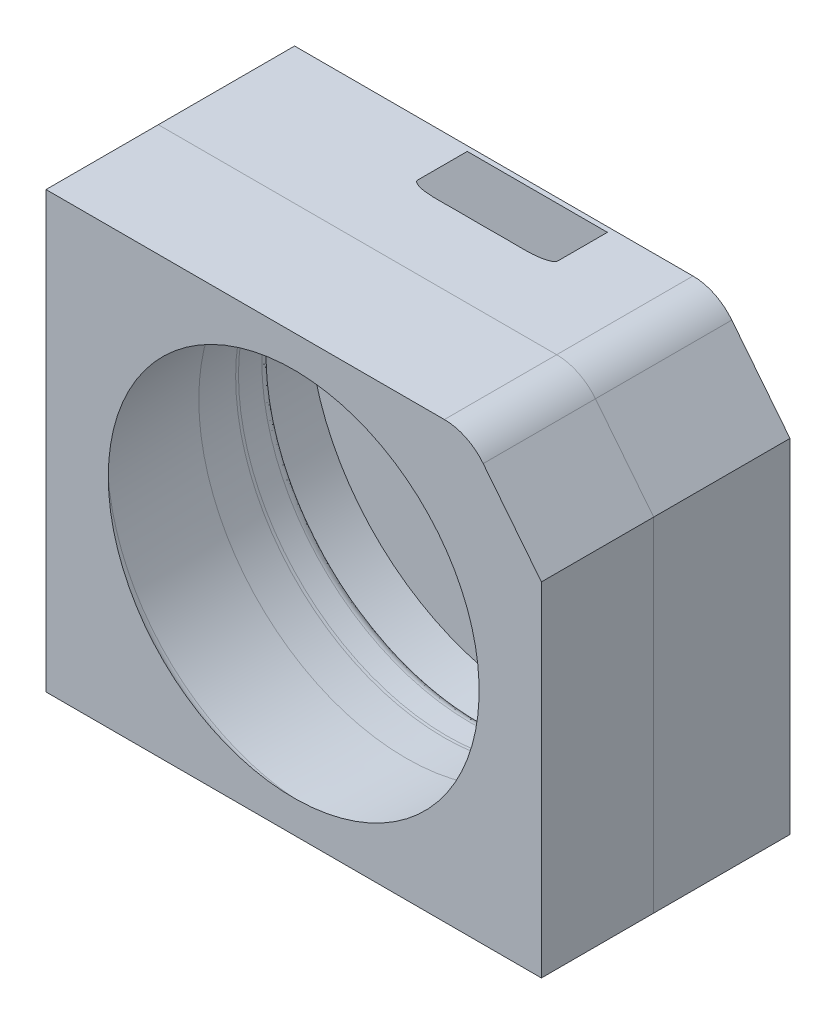
ISO-10303-21;
HEADER;
FILE_DESCRIPTION(('STEP AP214'),'2;1');
FILE_NAME('part.step','',(''),(''),'','','');
FILE_SCHEMA(('AUTOMOTIVE_DESIGN { 1 0 10303 214 1 1 1 1 }'));
ENDSEC;
DATA;
#1=APPLICATION_CONTEXT('core data for automotive mechanical design processes');
#2=APPLICATION_PROTOCOL_DEFINITION('international standard','automotive_design',2000,#1);
#3=PRODUCT_CONTEXT('',#1,'mechanical');
#4=PRODUCT('Part','Part','',(#3));
#5=PRODUCT_RELATED_PRODUCT_CATEGORY('part','',(#4));
#6=PRODUCT_DEFINITION_FORMATION('','',#4);
#7=PRODUCT_DEFINITION_CONTEXT('part definition',#1,'design');
#8=PRODUCT_DEFINITION('design','',#6,#7);
#9=PRODUCT_DEFINITION_SHAPE('','',#8);
#10=(LENGTH_UNIT() NAMED_UNIT(*) SI_UNIT(.MILLI.,.METRE.));
#11=(NAMED_UNIT(*) PLANE_ANGLE_UNIT() SI_UNIT($,.RADIAN.));
#12=(NAMED_UNIT(*) SI_UNIT($,.STERADIAN.) SOLID_ANGLE_UNIT());
#13=UNCERTAINTY_MEASURE_WITH_UNIT(LENGTH_MEASURE(1.E-05),#10,'distance_accuracy_value','');
#14=(GEOMETRIC_REPRESENTATION_CONTEXT(3) GLOBAL_UNCERTAINTY_ASSIGNED_CONTEXT((#13)) GLOBAL_UNIT_ASSIGNED_CONTEXT((#10,
#11,#12)) REPRESENTATION_CONTEXT('',''));
#15=CARTESIAN_POINT('',(0.,0.,0.));
#16=DIRECTION('',(0.,0.,1.));
#17=DIRECTION('',(1.,0.,0.));
#18=AXIS2_PLACEMENT_3D('',#15,#16,#17);
#19=CARTESIAN_POINT('',(0.,0.,82.55));
#20=DIRECTION('',(0.,0.,-1.));
#21=DIRECTION('',(-1.,0.,0.));
#22=AXIS2_PLACEMENT_3D('',#19,#20,#21);
#23=PLANE('',#22);
#24=DIRECTION('',(-1.,0.,0.));
#25=VECTOR('',#24,1.);
#26=CARTESIAN_POINT('',(0.,0.,82.55));
#27=LINE('',#26,#25);
#28=CARTESIAN_POINT('',(300.,0.,82.55));
#29=VERTEX_POINT('',#28);
#30=CARTESIAN_POINT('',(0.,0.,82.55));
#31=VERTEX_POINT('',#30);
#32=EDGE_CURVE('E141',#29,#31,#27,.T.);
#33=ORIENTED_EDGE('',*,*,#32,.T.);
#34=DIRECTION('',(0.,1.,0.));
#35=VECTOR('',#34,1.);
#36=CARTESIAN_POINT('',(0.,263.525,82.55));
#37=LINE('',#36,#35);
#38=CARTESIAN_POINT('',(0.,263.525,82.55));
#39=VERTEX_POINT('',#38);
#40=EDGE_CURVE('E137',#31,#39,#37,.T.);
#41=ORIENTED_EDGE('',*,*,#40,.T.);
#42=DIRECTION('',(-1.,0.,0.));
#43=VECTOR('',#42,1.);
#44=CARTESIAN_POINT('',(0.,263.525,82.55));
#45=LINE('',#44,#43);
#46=CARTESIAN_POINT('',(241.253264434507,263.525,82.55));
#47=VERTEX_POINT('',#46);
#48=EDGE_CURVE('E119',#47,#39,#45,.T.);
#49=ORIENTED_EDGE('',*,*,#48,.F.);
#50=CARTESIAN_POINT('',(241.253264434507,233.525,82.55));
#51=DIRECTION('',(0.,0.,-1.));
#52=DIRECTION('',(-1.,0.,0.));
#53=AXIS2_PLACEMENT_3D('',#50,#51,#52);
#54=CIRCLE('',#53,30.);
#55=CARTESIAN_POINT('',(264.758194807193,252.166841330061,82.55));
#56=VERTEX_POINT('',#55);
#57=EDGE_CURVE('E102',#47,#56,#54,.T.);
#58=ORIENTED_EDGE('',*,*,#57,.T.);
#59=DIRECTION('',(0.621394711002044,-0.783497679089534,0.));
#60=VECTOR('',#59,1.);
#61=CARTESIAN_POINT('',(264.758194807193,252.166841330061,82.55));
#62=LINE('',#61,#60);
#63=CARTESIAN_POINT('',(300.,207.73152173913,82.55));
#64=VERTEX_POINT('',#63);
#65=EDGE_CURVE('E116',#56,#64,#62,.T.);
#66=ORIENTED_EDGE('',*,*,#65,.T.);
#67=DIRECTION('',(0.,-1.,0.));
#68=VECTOR('',#67,1.);
#69=CARTESIAN_POINT('',(300.,0.,82.55));
#70=LINE('',#69,#68);
#71=EDGE_CURVE('E120',#64,#29,#70,.T.);
#72=ORIENTED_EDGE('',*,*,#71,.T.);
#73=EDGE_LOOP('',(#33,#41,#49,#58,#66,#72));
#74=FACE_BOUND('',#73,.T.);
#75=CARTESIAN_POINT('',(149.999999999996,131.762500000001,82.55));
#76=DIRECTION('',(0.,0.,-1.));
#77=DIRECTION('',(-1.,0.,0.));
#78=AXIS2_PLACEMENT_3D('',#75,#76,#77);
#79=CIRCLE('',#78,125.464805775742);
#80=CARTESIAN_POINT('',(24.5351942242544,131.762500000001,82.55));
#81=VERTEX_POINT('',#80);
#82=EDGE_CURVE('E125',#81,#81,#79,.F.);
#83=ORIENTED_EDGE('',*,*,#82,.T.);
#84=EDGE_LOOP('',(#83));
#85=FACE_BOUND('',#84,.T.);
#86=ADVANCED_FACE('F44',(#74,#85),#23,.T.);
#87=CARTESIAN_POINT('',(0.,263.525,0.));
#88=DIRECTION('',(0.,1.,0.));
#89=DIRECTION('',(0.,0.,1.));
#90=AXIS2_PLACEMENT_3D('',#87,#88,#89);
#91=PLANE('',#90);
#92=DIRECTION('',(0.,0.,-1.));
#93=VECTOR('',#92,1.);
#94=CARTESIAN_POINT('',(241.253264434507,263.525,286.76549888));
#95=LINE('',#94,#93);
#96=CARTESIAN_POINT('',(241.253264434507,263.525,150.542283063692));
#97=VERTEX_POINT('',#96);
#98=EDGE_CURVE('E12',#97,#47,#95,.T.);
#99=ORIENTED_EDGE('',*,*,#98,.T.);
#100=ORIENTED_EDGE('',*,*,#48,.T.);
#101=DIRECTION('',(0.,0.,-1.));
#102=VECTOR('',#101,1.);
#103=CARTESIAN_POINT('',(0.,263.525,286.76549888));
#104=LINE('',#103,#102);
#105=CARTESIAN_POINT('',(0.,263.525,150.542283063692));
#106=VERTEX_POINT('',#105);
#107=EDGE_CURVE('E52',#106,#39,#104,.T.);
#108=ORIENTED_EDGE('',*,*,#107,.F.);
#109=DIRECTION('',(-1.,0.,0.));
#110=VECTOR('',#109,1.);
#111=CARTESIAN_POINT('',(0.,263.525,150.542283063692));
#112=LINE('',#111,#110);
#113=EDGE_CURVE('E140',#97,#106,#112,.T.);
#114=ORIENTED_EDGE('',*,*,#113,.F.);
#115=EDGE_LOOP('',(#99,#100,#108,#114));
#116=FACE_BOUND('',#115,.T.);
#117=ADVANCED_FACE('F139',(#116),#91,.T.);
#118=CARTESIAN_POINT('',(0.,0.,286.76549888));
#119=DIRECTION('',(0.,1.,0.));
#120=DIRECTION('',(0.,0.,1.));
#121=AXIS2_PLACEMENT_3D('',#118,#119,#120);
#122=PLANE('',#121);
#123=ORIENTED_EDGE('',*,*,#32,.F.);
#124=DIRECTION('',(0.,0.,-1.));
#125=VECTOR('',#124,1.);
#126=CARTESIAN_POINT('',(300.,0.,286.76549888));
#127=LINE('',#126,#125);
#128=CARTESIAN_POINT('',(300.,0.,150.542283063692));
#129=VERTEX_POINT('',#128);
#130=EDGE_CURVE('E132',#129,#29,#127,.T.);
#131=ORIENTED_EDGE('',*,*,#130,.F.);
#132=DIRECTION('',(-1.,0.,0.));
#133=VECTOR('',#132,1.);
#134=CARTESIAN_POINT('',(0.,0.,150.542283063692));
#135=LINE('',#134,#133);
#136=CARTESIAN_POINT('',(0.,0.,150.542283063692));
#137=VERTEX_POINT('',#136);
#138=EDGE_CURVE('E59',#129,#137,#135,.T.);
#139=ORIENTED_EDGE('',*,*,#138,.T.);
#140=DIRECTION('',(0.,0.,-1.));
#141=VECTOR('',#140,1.);
#142=CARTESIAN_POINT('',(0.,0.,286.76549888));
#143=LINE('',#142,#141);
#144=EDGE_CURVE('E134',#137,#31,#143,.T.);
#145=ORIENTED_EDGE('',*,*,#144,.T.);
#146=EDGE_LOOP('',(#123,#131,#139,#145));
#147=FACE_BOUND('',#146,.T.);
#148=ADVANCED_FACE('F184',(#147),#122,.F.);
#149=CARTESIAN_POINT('',(0.,263.525,286.76549888));
#150=DIRECTION('',(1.,0.,0.));
#151=DIRECTION('',(0.,0.,-1.));
#152=AXIS2_PLACEMENT_3D('',#149,#150,#151);
#153=PLANE('',#152);
#154=ORIENTED_EDGE('',*,*,#40,.F.);
#155=ORIENTED_EDGE('',*,*,#144,.F.);
#156=DIRECTION('',(0.,1.,0.));
#157=VECTOR('',#156,1.);
#158=CARTESIAN_POINT('',(0.,263.525,150.542283063692));
#159=LINE('',#158,#157);
#160=EDGE_CURVE('E66',#137,#106,#159,.T.);
#161=ORIENTED_EDGE('',*,*,#160,.T.);
#162=ORIENTED_EDGE('',*,*,#107,.T.);
#163=EDGE_LOOP('',(#154,#155,#161,#162));
#164=FACE_BOUND('',#163,.T.);
#165=ADVANCED_FACE('F46',(#164),#153,.F.);
#166=CARTESIAN_POINT('',(300.,0.,286.76549888));
#167=DIRECTION('',(-1.,0.,0.));
#168=DIRECTION('',(0.,-1.,0.));
#169=AXIS2_PLACEMENT_3D('',#166,#167,#168);
#170=PLANE('',#169);
#171=ORIENTED_EDGE('',*,*,#71,.F.);
#172=DIRECTION('',(0.,0.,-1.));
#173=VECTOR('',#172,1.);
#174=CARTESIAN_POINT('',(300.,207.73152173913,286.76549888));
#175=LINE('',#174,#173);
#176=CARTESIAN_POINT('',(300.,207.73152173913,150.542283063692));
#177=VERTEX_POINT('',#176);
#178=EDGE_CURVE('E107',#177,#64,#175,.T.);
#179=ORIENTED_EDGE('',*,*,#178,.F.);
#180=DIRECTION('',(0.,-1.,0.));
#181=VECTOR('',#180,1.);
#182=CARTESIAN_POINT('',(300.,0.,150.542283063692));
#183=LINE('',#182,#181);
#184=EDGE_CURVE('E155',#177,#129,#183,.T.);
#185=ORIENTED_EDGE('',*,*,#184,.T.);
#186=ORIENTED_EDGE('',*,*,#130,.T.);
#187=EDGE_LOOP('',(#171,#179,#185,#186));
#188=FACE_BOUND('',#187,.T.);
#189=ADVANCED_FACE('F193',(#188),#170,.F.);
#190=CARTESIAN_POINT('',(241.253264434507,233.525,286.76549888));
#191=DIRECTION('',(0.,0.,-1.));
#192=DIRECTION('',(-1.,0.,0.));
#193=AXIS2_PLACEMENT_3D('',#190,#191,#192);
#194=CYLINDRICAL_SURFACE('',#193,30.);
#195=ORIENTED_EDGE('',*,*,#57,.F.);
#196=ORIENTED_EDGE('',*,*,#98,.F.);
#197=CARTESIAN_POINT('',(241.253264434507,233.525,150.542283063692));
#198=DIRECTION('',(0.,0.,-1.));
#199=DIRECTION('',(-1.,0.,0.));
#200=AXIS2_PLACEMENT_3D('',#197,#198,#199);
#201=CIRCLE('',#200,30.);
#202=CARTESIAN_POINT('',(264.758194807193,252.166841330061,150.542283063692));
#203=VERTEX_POINT('',#202);
#204=EDGE_CURVE('E104',#97,#203,#201,.T.);
#205=ORIENTED_EDGE('',*,*,#204,.T.);
#206=DIRECTION('',(0.,0.,-1.));
#207=VECTOR('',#206,1.);
#208=CARTESIAN_POINT('',(264.758194807193,252.166841330061,286.76549888));
#209=LINE('',#208,#207);
#210=EDGE_CURVE('E98',#203,#56,#209,.T.);
#211=ORIENTED_EDGE('',*,*,#210,.T.);
#212=EDGE_LOOP('',(#195,#196,#205,#211));
#213=FACE_BOUND('',#212,.T.);
#214=ADVANCED_FACE('F100',(#213),#194,.T.);
#215=CARTESIAN_POINT('',(264.758194807193,252.166841330061,286.76549888));
#216=DIRECTION('',(-0.783497679089534,-0.621394711002044,0.));
#217=DIRECTION('',(0.621394711002044,-0.783497679089534,0.));
#218=AXIS2_PLACEMENT_3D('',#215,#216,#217);
#219=PLANE('',#218);
#220=ORIENTED_EDGE('',*,*,#65,.F.);
#221=ORIENTED_EDGE('',*,*,#210,.F.);
#222=DIRECTION('',(0.621394711002044,-0.783497679089534,0.));
#223=VECTOR('',#222,1.);
#224=CARTESIAN_POINT('',(264.758194807193,252.166841330061,150.542283063692));
#225=LINE('',#224,#223);
#226=EDGE_CURVE('E153',#203,#177,#225,.T.);
#227=ORIENTED_EDGE('',*,*,#226,.T.);
#228=ORIENTED_EDGE('',*,*,#178,.T.);
#229=EDGE_LOOP('',(#220,#221,#227,#228));
#230=FACE_BOUND('',#229,.T.);
#231=ADVANCED_FACE('F122',(#230),#219,.F.);
#232=CARTESIAN_POINT('',(149.999999999997,131.762500000001,139.906228771618));
#233=DIRECTION('',(0.,0.,-1.));
#234=DIRECTION('',(-1.,0.,0.));
#235=AXIS2_PLACEMENT_3D('',#232,#233,#234);
#236=CONICAL_SURFACE('',#235,123.461882131892,0.0349065850398867);
#237=CARTESIAN_POINT('',(149.999999999997,131.762500000001,139.906228771618));
#238=DIRECTION('',(0.,0.,1.));
#239=DIRECTION('',(1.,0.,0.));
#240=AXIS2_PLACEMENT_3D('',#237,#238,#239);
#241=CIRCLE('',#240,123.461882131892);
#242=CARTESIAN_POINT('',(273.46188213189,131.762500000001,139.906228771616));
#243=VERTEX_POINT('',#242);
#244=EDGE_CURVE('E149',#243,#243,#241,.T.);
#245=ORIENTED_EDGE('',*,*,#244,.T.);
#246=EDGE_LOOP('',(#245));
#247=FACE_BOUND('',#246,.T.);
#248=ORIENTED_EDGE('',*,*,#82,.F.);
#249=EDGE_LOOP('',(#248));
#250=FACE_BOUND('',#249,.T.);
#251=ADVANCED_FACE('F170',(#247,#250),#236,.F.);
#252=CARTESIAN_POINT('',(0.,0.,150.542283063692));
#253=DIRECTION('',(0.,0.,-1.));
#254=DIRECTION('',(-1.,0.,0.));
#255=AXIS2_PLACEMENT_3D('',#252,#253,#254);
#256=PLANE('',#255);
#257=ORIENTED_EDGE('',*,*,#204,.F.);
#258=ORIENTED_EDGE('',*,*,#113,.T.);
#259=ORIENTED_EDGE('',*,*,#160,.F.);
#260=ORIENTED_EDGE('',*,*,#138,.F.);
#261=ORIENTED_EDGE('',*,*,#184,.F.);
#262=ORIENTED_EDGE('',*,*,#226,.F.);
#263=EDGE_LOOP('',(#257,#258,#259,#260,#261,#262));
#264=FACE_BOUND('',#263,.T.);
#265=CARTESIAN_POINT('',(149.999999999993,131.7625,150.542283063692));
#266=DIRECTION('',(0.,0.,-1.));
#267=DIRECTION('',(-1.,0.,0.));
#268=AXIS2_PLACEMENT_3D('',#265,#266,#267);
#269=CIRCLE('',#268,112.298492350913);
#270=CARTESIAN_POINT('',(37.7015076490804,131.7625,150.542283063692));
#271=VERTEX_POINT('',#270);
#272=EDGE_CURVE('E156',#271,#271,#269,.F.);
#273=ORIENTED_EDGE('',*,*,#272,.F.);
#274=EDGE_LOOP('',(#273));
#275=FACE_BOUND('',#274,.T.);
#276=ADVANCED_FACE('F167',(#264,#275),#256,.F.);
#277=CARTESIAN_POINT('',(149.999999999997,131.762500000001,139.592133301296));
#278=DIRECTION('',(0.,0.,1.));
#279=DIRECTION('',(1.,0.,0.));
#280=AXIS2_PLACEMENT_3D('',#277,#278,#279);
#281=TOROIDAL_SURFACE('',#280,114.46736468872,9.);
#282=ORIENTED_EDGE('',*,*,#244,.F.);
#283=EDGE_LOOP('',(#282));
#284=FACE_BOUND('',#283,.T.);
#285=CARTESIAN_POINT('',(149.999999999998,131.762500000001,147.74451663055));
#286=DIRECTION('',(0.,0.,1.));
#287=DIRECTION('',(1.,0.,0.));
#288=AXIS2_PLACEMENT_3D('',#285,#286,#287);
#289=CIRCLE('',#288,118.280322340321);
#290=CARTESIAN_POINT('',(268.280322340319,131.762500000001,147.744516630548));
#291=VERTEX_POINT('',#290);
#292=EDGE_CURVE('E108',#291,#291,#289,.T.);
#293=ORIENTED_EDGE('',*,*,#292,.T.);
#294=EDGE_LOOP('',(#293));
#295=FACE_BOUND('',#294,.T.);
#296=ADVANCED_FACE('F169',(#284,#295),#281,.F.);
#297=CARTESIAN_POINT('',(149.999999999998,131.7625,156.662637537934));
#298=DIRECTION('',(0.,0.,-1.));
#299=DIRECTION('',(-1.,0.,0.));
#300=AXIS2_PLACEMENT_3D('',#297,#298,#299);
#301=CONICAL_SURFACE('',#300,99.2127252525065,1.13331210913781);
#302=ORIENTED_EDGE('',*,*,#272,.T.);
#303=EDGE_LOOP('',(#302));
#304=FACE_BOUND('',#303,.T.);
#305=ORIENTED_EDGE('',*,*,#292,.F.);
#306=EDGE_LOOP('',(#305));
#307=FACE_BOUND('',#306,.T.);
#308=ADVANCED_FACE('F164',(#304,#307),#301,.F.);
#309=CLOSED_SHELL('',(#86,#117,#148,#165,#189,#214,#231,#251,#276,#296,#308));
#310=MANIFOLD_SOLID_BREP('B2',#309);
#311=CARTESIAN_POINT('',(0.,0.,82.55));
#312=DIRECTION('',(0.,0.,-1.));
#313=DIRECTION('',(-1.,0.,0.));
#314=AXIS2_PLACEMENT_3D('',#311,#312,#313);
#315=PLANE('',#314);
#316=CARTESIAN_POINT('',(149.999999999996,131.762500000001,82.55));
#317=DIRECTION('',(0.,0.,-1.));
#318=DIRECTION('',(-1.,0.,0.));
#319=AXIS2_PLACEMENT_3D('',#316,#317,#318);
#320=CIRCLE('',#319,125.464805775742);
#321=CARTESIAN_POINT('',(24.5351942242544,131.762500000001,82.55));
#322=VERTEX_POINT('',#321);
#323=EDGE_CURVE('E526',#322,#322,#320,.F.);
#324=ORIENTED_EDGE('',*,*,#323,.F.);
#325=EDGE_LOOP('',(#324));
#326=FACE_BOUND('',#325,.T.);
#327=DIRECTION('',(-1.,0.,0.));
#328=VECTOR('',#327,1.);
#329=CARTESIAN_POINT('',(0.,0.,82.55));
#330=LINE('',#329,#328);
#331=CARTESIAN_POINT('',(300.,0.,82.55));
#332=VERTEX_POINT('',#331);
#333=CARTESIAN_POINT('',(0.,0.,82.55));
#334=VERTEX_POINT('',#333);
#335=EDGE_CURVE('E290',#332,#334,#330,.T.);
#336=ORIENTED_EDGE('',*,*,#335,.F.);
#337=DIRECTION('',(0.,-1.,0.));
#338=VECTOR('',#337,1.);
#339=CARTESIAN_POINT('',(300.,0.,82.55));
#340=LINE('',#339,#338);
#341=CARTESIAN_POINT('',(300.,207.73152173913,82.55));
#342=VERTEX_POINT('',#341);
#343=EDGE_CURVE('E536',#342,#332,#340,.T.);
#344=ORIENTED_EDGE('',*,*,#343,.F.);
#345=DIRECTION('',(0.621394711002044,-0.783497679089534,0.));
#346=VECTOR('',#345,1.);
#347=CARTESIAN_POINT('',(264.758194807193,252.166841330061,82.55));
#348=LINE('',#347,#346);
#349=CARTESIAN_POINT('',(264.758194807193,252.166841330061,82.55));
#350=VERTEX_POINT('',#349);
#351=EDGE_CURVE('E529',#350,#342,#348,.T.);
#352=ORIENTED_EDGE('',*,*,#351,.F.);
#353=CARTESIAN_POINT('',(241.253264434507,233.525,82.55));
#354=DIRECTION('',(0.,0.,-1.));
#355=DIRECTION('',(-1.,0.,0.));
#356=AXIS2_PLACEMENT_3D('',#353,#354,#355);
#357=CIRCLE('',#356,30.);
#358=CARTESIAN_POINT('',(241.253264434507,263.525,82.55));
#359=VERTEX_POINT('',#358);
#360=EDGE_CURVE('E532',#359,#350,#357,.T.);
#361=ORIENTED_EDGE('',*,*,#360,.F.);
#362=DIRECTION('',(-1.,0.,0.));
#363=VECTOR('',#362,1.);
#364=CARTESIAN_POINT('',(0.,263.525,82.55));
#365=LINE('',#364,#363);
#366=CARTESIAN_POINT('',(0.,263.525,82.55));
#367=VERTEX_POINT('',#366);
#368=EDGE_CURVE('E42',#359,#367,#365,.T.);
#369=ORIENTED_EDGE('',*,*,#368,.T.);
#370=DIRECTION('',(0.,1.,0.));
#371=VECTOR('',#370,1.);
#372=CARTESIAN_POINT('',(0.,263.525,82.55));
#373=LINE('',#372,#371);
#374=EDGE_CURVE('E285',#334,#367,#373,.T.);
#375=ORIENTED_EDGE('',*,*,#374,.F.);
#376=EDGE_LOOP('',(#336,#344,#352,#361,#369,#375));
#377=FACE_BOUND('',#376,.T.);
#378=ADVANCED_FACE('F282',(#326,#377),#315,.F.);
#379=CARTESIAN_POINT('',(149.999999999999,131.7625,200.400182821007));
#380=DIRECTION('',(0.,0.,1.));
#381=DIRECTION('',(1.,0.,0.));
#382=AXIS2_PLACEMENT_3D('',#379,#380,#381);
#383=CYLINDRICAL_SURFACE('',#382,126.302452500002);
#384=CARTESIAN_POINT('',(149.999999999996,131.762500000001,43.5629362424853));
#385=DIRECTION('',(0.,0.,1.));
#386=DIRECTION('',(1.,0.,0.));
#387=AXIS2_PLACEMENT_3D('',#384,#385,#386);
#388=CIRCLE('',#387,126.302452500002);
#389=CARTESIAN_POINT('',(276.302452499998,131.762500000001,43.5629362424831));
#390=VERTEX_POINT('',#389);
#391=EDGE_CURVE('E524',#390,#390,#388,.T.);
#392=ORIENTED_EDGE('',*,*,#391,.F.);
#393=EDGE_LOOP('',(#392));
#394=FACE_BOUND('',#393,.T.);
#395=CARTESIAN_POINT('',(149.999999999996,131.762500000001,57.6901829960745));
#396=DIRECTION('',(0.,0.,1.));
#397=DIRECTION('',(1.,0.,0.));
#398=AXIS2_PLACEMENT_3D('',#395,#396,#397);
#399=CIRCLE('',#398,126.302452500002);
#400=CARTESIAN_POINT('',(276.302452499998,131.762500000001,57.6901829960723));
#401=VERTEX_POINT('',#400);
#402=EDGE_CURVE('E522',#401,#401,#399,.T.);
#403=ORIENTED_EDGE('',*,*,#402,.T.);
#404=EDGE_LOOP('',(#403));
#405=FACE_BOUND('',#404,.T.);
#406=ADVANCED_FACE('F427',(#394,#405),#383,.F.);
#407=CARTESIAN_POINT('',(149.999999999996,131.762500000001,57.6901829960742));
#408=DIRECTION('',(0.,0.,1.));
#409=DIRECTION('',(1.,0.,0.));
#410=AXIS2_PLACEMENT_3D('',#407,#408,#409);
#411=TOROIDAL_SURFACE('',#410,76.302452500002,50.);
#412=CARTESIAN_POINT('',(149.999999999996,131.762500000001,59.4351578311995));
#413=DIRECTION('',(0.,0.,1.));
#414=DIRECTION('',(1.,0.,0.));
#415=AXIS2_PLACEMENT_3D('',#412,#413,#414);
#416=CIRCLE('',#415,126.271993850957);
#417=CARTESIAN_POINT('',(276.271993850953,131.762500000001,59.4351578311973));
#418=VERTEX_POINT('',#417);
#419=EDGE_CURVE('E407',#418,#418,#416,.T.);
#420=ORIENTED_EDGE('',*,*,#419,.T.);
#421=EDGE_LOOP('',(#420));
#422=FACE_BOUND('',#421,.T.);
#423=ORIENTED_EDGE('',*,*,#402,.F.);
#424=EDGE_LOOP('',(#423));
#425=FACE_BOUND('',#424,.T.);
#426=ADVANCED_FACE('F589',(#422,#425),#411,.F.);
#427=CARTESIAN_POINT('',(149.999999999997,131.762500000001,139.906228771618));
#428=DIRECTION('',(0.,0.,-1.));
#429=DIRECTION('',(-1.,0.,0.));
#430=AXIS2_PLACEMENT_3D('',#427,#428,#429);
#431=CONICAL_SURFACE('',#430,123.461882131892,0.0349065850398867);
#432=ORIENTED_EDGE('',*,*,#323,.T.);
#433=EDGE_LOOP('',(#432));
#434=FACE_BOUND('',#433,.T.);
#435=ORIENTED_EDGE('',*,*,#419,.F.);
#436=EDGE_LOOP('',(#435));
#437=FACE_BOUND('',#436,.T.);
#438=ADVANCED_FACE('F605',(#434,#437),#431,.F.);
#439=CARTESIAN_POINT('',(0.,-28.,0.));
#440=DIRECTION('',(0.,-1.,0.));
#441=DIRECTION('',(0.,0.,-1.));
#442=AXIS2_PLACEMENT_3D('',#439,#440,#441);
#443=PLANE('',#442);
#444=DIRECTION('',(0.,0.,-1.));
#445=VECTOR('',#444,1.);
#446=CARTESIAN_POINT('',(60.,-28.,55.));
#447=LINE('',#446,#445);
#448=CARTESIAN_POINT('',(60.,-28.,55.));
#449=VERTEX_POINT('',#448);
#450=CARTESIAN_POINT('',(60.,-28.,0.));
#451=VERTEX_POINT('',#450);
#452=EDGE_CURVE('E508',#449,#451,#447,.T.);
#453=ORIENTED_EDGE('',*,*,#452,.T.);
#454=DIRECTION('',(1.,0.,0.));
#455=VECTOR('',#454,1.);
#456=CARTESIAN_POINT('',(60.,-28.,0.));
#457=LINE('',#456,#455);
#458=CARTESIAN_POINT('',(240.,-28.,0.));
#459=VERTEX_POINT('',#458);
#460=EDGE_CURVE('E516',#451,#459,#457,.T.);
#461=ORIENTED_EDGE('',*,*,#460,.T.);
#462=DIRECTION('',(0.,0.,1.));
#463=VECTOR('',#462,1.);
#464=CARTESIAN_POINT('',(240.,-28.,0.));
#465=LINE('',#464,#463);
#466=CARTESIAN_POINT('',(240.,-28.,55.));
#467=VERTEX_POINT('',#466);
#468=EDGE_CURVE('E514',#459,#467,#465,.T.);
#469=ORIENTED_EDGE('',*,*,#468,.T.);
#470=DIRECTION('',(-1.,0.,0.));
#471=VECTOR('',#470,1.);
#472=CARTESIAN_POINT('',(240.,-28.,55.));
#473=LINE('',#472,#471);
#474=EDGE_CURVE('E503',#467,#449,#473,.T.);
#475=ORIENTED_EDGE('',*,*,#474,.T.);
#476=EDGE_LOOP('',(#453,#461,#469,#475));
#477=FACE_BOUND('',#476,.T.);
#478=ADVANCED_FACE('F558',(#477),#443,.T.);
#479=CARTESIAN_POINT('',(149.999999999995,131.762500000001,3.00000000251865));
#480=DIRECTION('',(0.,0.,1.));
#481=DIRECTION('',(1.,0.,0.));
#482=AXIS2_PLACEMENT_3D('',#479,#480,#481);
#483=PLANE('',#482);
#484=CARTESIAN_POINT('',(149.999999999995,131.762500000001,3.00000000251865));
#485=DIRECTION('',(0.,0.,1.));
#486=DIRECTION('',(1.,0.,0.));
#487=AXIS2_PLACEMENT_3D('',#484,#485,#486);
#488=CIRCLE('',#487,138.427487940002);
#489=CARTESIAN_POINT('',(107.564012782426,263.525,3.00000000251986));
#490=VERTEX_POINT('',#489);
#491=CARTESIAN_POINT('',(192.435987217564,263.525,3.00000000251837));
#492=VERTEX_POINT('',#491);
#493=EDGE_CURVE('E386',#490,#492,#488,.T.);
#494=ORIENTED_EDGE('',*,*,#493,.T.);
#495=DIRECTION('',(-1.,0.,0.));
#496=VECTOR('',#495,1.);
#497=CARTESIAN_POINT('',(149.999999999995,263.525,3.00000000251911));
#498=LINE('',#497,#496);
#499=EDGE_CURVE('E399',#492,#490,#498,.T.);
#500=ORIENTED_EDGE('',*,*,#499,.T.);
#501=EDGE_LOOP('',(#494,#500));
#502=FACE_BOUND('',#501,.T.);
#503=ADVANCED_FACE('F457',(#502),#483,.T.);
#504=CARTESIAN_POINT('',(149.999999999999,131.7625,200.400182821007));
#505=DIRECTION('',(0.,0.,1.));
#506=DIRECTION('',(1.,0.,0.));
#507=AXIS2_PLACEMENT_3D('',#504,#505,#506);
#508=CYLINDRICAL_SURFACE('',#507,138.427487940002);
#509=DIRECTION('',(0.,0.,1.));
#510=VECTOR('',#509,1.);
#511=CARTESIAN_POINT('',(107.564012782432,263.525,200.400182821008));
#512=LINE('',#511,#510);
#513=CARTESIAN_POINT('',(107.564012782429,263.525000000001,33.0000000025199));
#514=VERTEX_POINT('',#513);
#515=EDGE_CURVE('E382',#514,#490,#512,.F.);
#516=ORIENTED_EDGE('',*,*,#515,.F.);
#517=CARTESIAN_POINT('',(149.999999999996,131.762500000001,33.0000000025187));
#518=DIRECTION('',(0.,0.,1.));
#519=DIRECTION('',(1.,0.,0.));
#520=AXIS2_PLACEMENT_3D('',#517,#518,#519);
#521=CIRCLE('',#520,138.427487940002);
#522=CARTESIAN_POINT('',(192.435987217562,263.525000000001,33.0000000025184));
#523=VERTEX_POINT('',#522);
#524=EDGE_CURVE('E374',#514,#523,#521,.T.);
#525=ORIENTED_EDGE('',*,*,#524,.T.);
#526=DIRECTION('',(0.,0.,1.));
#527=VECTOR('',#526,1.);
#528=CARTESIAN_POINT('',(192.435987217565,263.525,200.400182821006));
#529=LINE('',#528,#527);
#530=EDGE_CURVE('E379',#492,#523,#529,.T.);
#531=ORIENTED_EDGE('',*,*,#530,.F.);
#532=ORIENTED_EDGE('',*,*,#493,.F.);
#533=EDGE_LOOP('',(#516,#525,#531,#532));
#534=FACE_BOUND('',#533,.T.);
#535=ADVANCED_FACE('F376',(#534),#508,.F.);
#536=CARTESIAN_POINT('',(283.519735499998,131.762500000001,37.2754741948837));
#537=CARTESIAN_POINT('',(286.705561076155,131.762500000001,37.7272814708559));
#538=CARTESIAN_POINT('',(288.427487939998,131.762500000001,35.3951219955774));
#539=CARTESIAN_POINT('',(288.427487939998,131.762500000001,33.0000000025163));
#540=(BOUNDED_CURVE() B_SPLINE_CURVE(3,(#536,#537,#538,#539),.UNSPECIFIED.,.F.,
.F.) B_SPLINE_CURVE_WITH_KNOTS((4,4),(0.,1.),
.UNSPECIFIED.) CURVE() GEOMETRIC_REPRESENTATION_ITEM() RATIONAL_B_SPLINE_CURVE((0.255591691964592,
0.242825015050017,0.327183181081988,0.508666190060503)) REPRESENTATION_ITEM(''));
#541=CARTESIAN_POINT('',(149.999999999999,131.7625,200.400182821007));
#542=DIRECTION('',(0.,0.,1.));
#543=AXIS1_PLACEMENT('',#541,#542);
#544=SURFACE_OF_REVOLUTION('',#540,#543);
#545=CARTESIAN_POINT('',(192.435987217564,263.525,33.0000000025184));
#546=CARTESIAN_POINT('',(192.436011088802,263.525,33.0434393153706));
#547=CARTESIAN_POINT('',(192.433856176102,263.525,33.08686429808));
#548=CARTESIAN_POINT('',(192.425375267438,263.525,33.1732424197555));
#549=CARTESIAN_POINT('',(192.419055448113,263.525,33.2161961618266));
#550=CARTESIAN_POINT('',(192.402545183961,263.525,33.3007307171293));
#551=CARTESIAN_POINT('',(192.392409485246,263.525,33.3423223025522));
#552=CARTESIAN_POINT('',(192.368567292052,263.525,33.4244716410908));
#553=CARTESIAN_POINT('',(192.354859356591,263.525,33.4650289697393));
#554=CARTESIAN_POINT('',(192.301511476489,263.525,33.6040140451591));
#555=CARTESIAN_POINT('',(192.253507947504,263.525,33.6992960167715));
#556=CARTESIAN_POINT('',(192.142841416342,263.525,33.8812901528896));
#557=CARTESIAN_POINT('',(192.080093419695,263.525,33.9679483186598));
#558=CARTESIAN_POINT('',(191.954284243189,263.525,34.1207884449622));
#559=CARTESIAN_POINT('',(191.892588833982,263.525,34.1881171948751));
#560=CARTESIAN_POINT('',(191.76361436149,263.525,34.3172409887717));
#561=CARTESIAN_POINT('',(191.69633098353,263.525,34.3790316786258));
#562=CARTESIAN_POINT('',(191.557507292685,263.525,34.4977629716423));
#563=CARTESIAN_POINT('',(191.485961852969,263.525,34.5546975247703));
#564=CARTESIAN_POINT('',(191.339676363574,263.525,34.6642181857243));
#565=CARTESIAN_POINT('',(191.264937266281,263.525,34.7168055763861));
#566=CARTESIAN_POINT('',(191.044517053055,263.525,34.8638515831894));
#567=CARTESIAN_POINT('',(190.895546915487,263.525,34.953381809466));
#568=CARTESIAN_POINT('',(190.591465649165,263.525,35.121723090095));
#569=CARTESIAN_POINT('',(190.436344420284,263.525,35.200515485043));
#570=CARTESIAN_POINT('',(190.121817517514,263.525,35.3493041042936));
#571=CARTESIAN_POINT('',(189.962408495746,263.525,35.4192931978977));
#572=CARTESIAN_POINT('',(189.639705637532,263.525,35.5522455571298));
#573=CARTESIAN_POINT('',(189.476395446229,263.525,35.6151687515782));
#574=CARTESIAN_POINT('',(189.147667328852,263.525,35.7346221830566));
#575=CARTESIAN_POINT('',(188.9822518683,263.525,35.7911592477392));
#576=CARTESIAN_POINT('',(188.649731164323,263.525,35.8987655906204));
#577=CARTESIAN_POINT('',(188.482626571709,263.525,35.9498368929843));
#578=CARTESIAN_POINT('',(188.090578275526,263.525,36.0636119881741));
#579=CARTESIAN_POINT('',(187.865093092547,263.525,36.1244472986276));
#580=CARTESIAN_POINT('',(187.412286167399,263.525,36.2389021600035));
#581=CARTESIAN_POINT('',(187.184964195884,263.525,36.2925207946019));
#582=CARTESIAN_POINT('',(186.728637477402,263.525,36.3935729941319));
#583=CARTESIAN_POINT('',(186.49963088723,263.525,36.4409981956179));
#584=CARTESIAN_POINT('',(186.040542547323,263.525,36.5303478237254));
#585=CARTESIAN_POINT('',(185.810460738945,263.525,36.5722719465985));
#586=CARTESIAN_POINT('',(185.118289882874,263.525,36.6908713714814));
#587=CARTESIAN_POINT('',(184.654941060859,263.525,36.760230551034));
#588=CARTESIAN_POINT('',(183.726117370076,263.525,36.8832723715313));
#589=CARTESIAN_POINT('',(183.260642037482,263.525,36.9369514085709));
#590=CARTESIAN_POINT('',(182.327633321121,263.525,37.031398365197));
#591=CARTESIAN_POINT('',(181.860097819882,263.525,37.0721451074196));
#592=CARTESIAN_POINT('',(180.92477699676,263.525,37.1426513582292));
#593=CARTESIAN_POINT('',(180.456992640789,263.525,37.1724239361714));
#594=CARTESIAN_POINT('',(179.521177447414,263.525,37.222679734808));
#595=CARTESIAN_POINT('',(179.053146862595,263.525,37.2431677516688));
#596=CARTESIAN_POINT('',(178.11682870838,263.525,37.276222912991));
#597=CARTESIAN_POINT('',(177.648541148668,263.525,37.2887903378332));
#598=CARTESIAN_POINT('',(176.868720646019,263.525,37.3040646799131));
#599=CARTESIAN_POINT('',(176.55722232422,263.525,37.3086644314647));
#600=CARTESIAN_POINT('',(175.934144765646,263.525,37.3151557165912));
#601=CARTESIAN_POINT('',(175.6225655241,263.525,37.3170467915974));
#602=CARTESIAN_POINT('',(174.9993723003,263.525,37.3183916086863));
#603=CARTESIAN_POINT('',(174.68775831762,263.525,37.3178451131127));
#604=CARTESIAN_POINT('',(174.066591723463,263.525,37.3145762343992));
#605=CARTESIAN_POINT('',(173.7570390334,263.525,37.3118681852725));
#606=CARTESIAN_POINT('',(173.137988594077,263.525,37.3045255586765));
#607=CARTESIAN_POINT('',(172.82849084243,263.525,37.2998911770294));
#608=CARTESIAN_POINT('',(172.209594792562,263.525,37.2889117740157));
#609=CARTESIAN_POINT('',(171.900196487588,263.525,37.2825671358309));
#610=CARTESIAN_POINT('',(171.590816606617,263.525,37.2754741948861));
#611=B_SPLINE_CURVE_WITH_KNOTS('',3,(#545,#546,#547,#548,#549,#550,#551,#552,#553,#554,#555,
#556,#557,#558,#559,#560,#561,#562,#563,#564,#565,#566,#567,#568,#569,#570,#571,#572,#573,#574,
#575,#576,#577,#578,#579,#580,#581,#582,#583,#584,#585,#586,#587,#588,#589,#590,#591,#592,#593,
#594,#595,#596,#597,#598,#599,#600,#601,#602,#603,#604,#605,#606,#607,#608,#609,#610),
.UNSPECIFIED.,.F.,.F.,(4,2,2,2,2,2,2,2,2,2,2,2,2,2,2,2,2,2,2,2,2,2,2,2,2,2,2,2,2,2,2,2,4),(0.,
0.130241429364157,0.260290141443698,0.388540068376575,0.516841809550153,0.834941817756816,
1.15492255672254,1.42848738000307,1.70226543229465,1.97637973595619,2.25041285831362,
2.77116249270016,3.29280581231198,3.81486898006165,4.33975738168852,4.86407918468506,
5.38820613589385,6.08869943050761,6.78928158522914,7.4908002146554,8.19235756294127,
9.5975130980863,11.0029913388343,12.4107593945532,13.8168454520471,15.2222043311899,
16.6275134592834,17.5620991178346,18.4968429794914,19.431677977976,20.3603647546448,
21.2889571482922,22.2173416641275),.UNSPECIFIED.);
#612=CARTESIAN_POINT('',(171.590816606617,263.525,37.2754741948862));
#613=VERTEX_POINT('',#612);
#614=EDGE_CURVE('E390',#523,#613,#611,.T.);
#615=ORIENTED_EDGE('',*,*,#614,.F.);
#616=ORIENTED_EDGE('',*,*,#524,.F.);
#617=CARTESIAN_POINT('',(128.409183393374,263.525,37.2754741948868));
#618=CARTESIAN_POINT('',(128.051894710239,263.525,37.2836641761605));
#619=CARTESIAN_POINT('',(127.6945808691,263.525,37.2908580436216));
#620=CARTESIAN_POINT('',(126.979800252876,263.525,37.3029213767301));
#621=CARTESIAN_POINT('',(126.622333465375,263.525,37.3077900998672));
#622=CARTESIAN_POINT('',(125.907308636066,263.525,37.3148659469851));
#623=CARTESIAN_POINT('',(125.549750589352,263.525,37.3170725961095));
#624=CARTESIAN_POINT('',(124.834606252839,263.525,37.3184574758383));
#625=CARTESIAN_POINT('',(124.477019962629,263.525,37.3176355252875));
#626=CARTESIAN_POINT('',(123.760859504184,263.525,37.3125603889058));
#627=CARTESIAN_POINT('',(123.402285400806,263.525,37.3082975102587));
#628=CARTESIAN_POINT('',(122.685229894357,263.525,37.2958901570463));
#629=CARTESIAN_POINT('',(122.326748486316,263.525,37.2877459769455));
#630=CARTESIAN_POINT('',(121.60994018102,263.525,37.2670886446054));
#631=CARTESIAN_POINT('',(121.251613273173,263.525,37.2545758660324));
#632=CARTESIAN_POINT('',(120.53517713601,263.525,37.2246302296394));
#633=CARTESIAN_POINT('',(120.177067898286,263.525,37.2071975758378));
#634=CARTESIAN_POINT('',(119.472458511016,263.525,37.1674163274857));
#635=CARTESIAN_POINT('',(119.125948714547,263.525,37.1452402692858));
#636=CARTESIAN_POINT('',(118.433337233113,263.525,37.0950078689188));
#637=CARTESIAN_POINT('',(118.087235565238,263.525,37.0669512887018));
#638=CARTESIAN_POINT('',(117.39558596318,263.525,37.0041603520604));
#639=CARTESIAN_POINT('',(117.050038109821,263.525,36.9694250971018));
#640=CARTESIAN_POINT('',(116.359590004402,263.525,36.8922968555982));
#641=CARTESIAN_POINT('',(116.014690234281,263.525,36.8498995114988));
#642=CARTESIAN_POINT('',(115.326116320868,263.525,36.7562713772811));
#643=CARTESIAN_POINT('',(114.982442058973,263.525,36.7050414670269));
#644=CARTESIAN_POINT('',(114.296852999469,263.525,36.5922400283021));
#645=CARTESIAN_POINT('',(113.954937812492,263.525,36.5306708997104));
#646=CARTESIAN_POINT('',(113.342578387325,263.525,36.4088892849372));
#647=CARTESIAN_POINT('',(113.071688159953,263.525,36.350928985456));
#648=CARTESIAN_POINT('',(112.531986217608,263.525,36.2257654929522));
#649=CARTESIAN_POINT('',(112.263174825383,263.525,36.1585608939787));
#650=CARTESIAN_POINT('',(111.729479500192,263.525,36.0133604224585));
#651=CARTESIAN_POINT('',(111.464584999961,263.525,35.9354037755901));
#652=CARTESIAN_POINT('',(110.939177098807,263.525,35.7660655485733));
#653=CARTESIAN_POINT('',(110.678661894095,263.525,35.6746896545641));
#654=CARTESIAN_POINT('',(110.223056142982,263.525,35.4977009565297));
#655=CARTESIAN_POINT('',(110.026636970608,263.525,35.4155548510646));
#656=CARTESIAN_POINT('',(109.735818493693,263.525,35.2826000075541));
#657=CARTESIAN_POINT('',(109.639255498186,263.525,35.2365197732933));
#658=CARTESIAN_POINT('',(109.447949554132,263.525,35.1407358617284));
#659=CARTESIAN_POINT('',(109.35320641394,263.525,35.091032568634));
#660=CARTESIAN_POINT('',(109.138333573493,263.525,34.9722147119986));
#661=CARTESIAN_POINT('',(109.018968390922,263.525,34.9017020260968));
#662=CARTESIAN_POINT('',(108.785349757699,263.525,34.7522949595584));
#663=CARTESIAN_POINT('',(108.671101925771,263.525,34.6733916720582));
#664=CARTESIAN_POINT('',(108.450989762533,263.525,34.506097782546));
#665=CARTESIAN_POINT('',(108.345070978818,263.525,34.4177796013186));
#666=CARTESIAN_POINT('',(108.144622993734,263.525,34.2291331654217));
#667=CARTESIAN_POINT('',(108.050062419983,263.525,34.1288395928631));
#668=CARTESIAN_POINT('',(107.935041881477,263.525,33.9848109789745));
#669=CARTESIAN_POINT('',(107.906759946686,263.525,33.9472762981489));
#670=CARTESIAN_POINT('',(107.852620597751,263.525,33.8704851403311));
#671=CARTESIAN_POINT('',(107.826763127543,263.525,33.8312287031852));
#672=CARTESIAN_POINT('',(107.777981826993,263.525,33.7511543108066));
#673=CARTESIAN_POINT('',(107.755045988739,263.525,33.7103437059798));
#674=CARTESIAN_POINT('',(107.712426164581,263.525,33.6270452176555));
#675=CARTESIAN_POINT('',(107.692742285601,263.525,33.584557279064));
#676=CARTESIAN_POINT('',(107.657416466249,263.525,33.4987945123038));
#677=CARTESIAN_POINT('',(107.641709629132,263.525,33.4555465963542));
#678=CARTESIAN_POINT('',(107.61433987614,263.525,33.367798178957));
#679=CARTESIAN_POINT('',(107.602675383712,263.525,33.3232981731746));
#680=CARTESIAN_POINT('',(107.583625199713,263.525,33.2326422484606));
#681=CARTESIAN_POINT('',(107.576310440143,263.525,33.1864712531426));
#682=CARTESIAN_POINT('',(107.566483790554,263.525,33.093540588437));
#683=CARTESIAN_POINT('',(107.563980524835,263.525,33.0467800129328));
#684=CARTESIAN_POINT('',(107.564012782427,263.525,33.0000000025199));
#685=B_SPLINE_CURVE_WITH_KNOTS('',3,(#617,#618,#619,#620,#621,#622,#623,#624,#625,#626,#627,
#628,#629,#630,#631,#632,#633,#634,#635,#636,#637,#638,#639,#640,#641,#642,#643,#644,#645,#646,
#647,#648,#649,#650,#651,#652,#653,#654,#655,#656,#657,#658,#659,#660,#661,#662,#663,#664,#665,
#666,#667,#668,#669,#670,#671,#672,#673,#674,#675,#676,#677,#678,#679,#680,#681,#682,#683,#684),
.UNSPECIFIED.,.F.,.F.,(4,2,2,2,2,2,2,2,2,2,2,2,2,2,2,2,2,2,2,2,2,2,2,2,2,2,2,2,2,2,2,2,2,4),(0.,
1.07214969800926,2.14464154708534,3.21732467720169,4.29007197070426,5.36585169632604,
6.44154981826362,7.51715595332175,8.59271749148728,9.63432970381734,10.6759840898922,
11.7177787160515,12.7601677029906,13.802452911334,14.8444965240809,15.6754296450747,
16.5064892813857,17.3345935148826,18.1623478627303,18.8006703086957,19.1215899108674,
19.4424755302602,19.8581120492394,20.2741942678702,20.6872798417487,21.0991968367766,
21.2401141352356,21.3810281741905,21.5213429653124,21.6616623690712,21.799518187145,
21.9373201794314,22.0773117464936,22.2175540064837),.UNSPECIFIED.);
#686=CARTESIAN_POINT('',(128.409183393374,263.525,37.2754741948869));
#687=VERTEX_POINT('',#686);
#688=EDGE_CURVE('E396',#687,#514,#685,.T.);
#689=ORIENTED_EDGE('',*,*,#688,.F.);
#690=CARTESIAN_POINT('',(149.999999999996,131.762500000001,37.2754741948861));
#691=DIRECTION('',(0.,0.,1.));
#692=DIRECTION('',(1.,0.,0.));
#693=AXIS2_PLACEMENT_3D('',#690,#691,#692);
#694=CIRCLE('',#693,133.519735500002);
#695=EDGE_CURVE('E387',#687,#613,#694,.T.);
#696=ORIENTED_EDGE('',*,*,#695,.T.);
#697=EDGE_LOOP('',(#615,#616,#689,#696));
#698=FACE_BOUND('',#697,.T.);
#699=ADVANCED_FACE('F391',(#698),#544,.T.);
#700=CARTESIAN_POINT('',(283.519735499998,131.762500000001,37.2754741948838));
#701=CARTESIAN_POINT('',(278.834697888002,131.762500000001,36.6110517302186));
#702=CARTESIAN_POINT('',(276.302452499998,131.762500000001,40.0406980173928));
#703=CARTESIAN_POINT('',(276.302452499998,131.762500000001,43.5629362424831));
#704=(BOUNDED_CURVE() B_SPLINE_CURVE(3,(#700,#701,#702,#703),.UNSPECIFIED.,.F.,
.F.) B_SPLINE_CURVE_WITH_KNOTS((4,4),(0.,1.),
.UNSPECIFIED.) CURVE() GEOMETRIC_REPRESENTATION_ITEM() RATIONAL_B_SPLINE_CURVE((0.255591691964593,
0.242825015050018,0.327183181081988,0.508666190060503)) REPRESENTATION_ITEM(''));
#705=CARTESIAN_POINT('',(149.999999999999,131.7625,200.400182821007));
#706=DIRECTION('',(0.,0.,1.));
#707=AXIS1_PLACEMENT('',#705,#706);
#708=SURFACE_OF_REVOLUTION('',#704,#707);
#709=ORIENTED_EDGE('',*,*,#391,.T.);
#710=EDGE_LOOP('',(#709));
#711=FACE_BOUND('',#710,.T.);
#712=ORIENTED_EDGE('',*,*,#695,.F.);
#713=CARTESIAN_POINT('',(128.409183393375,263.525,37.2754741948869));
#714=CARTESIAN_POINT('',(128.935315344216,263.525,37.2634224363284));
#715=CARTESIAN_POINT('',(129.461491505504,263.525,37.2535435033356));
#716=CARTESIAN_POINT('',(130.513852839061,263.525,37.237426466283));
#717=CARTESIAN_POINT('',(131.040038006218,263.525,37.2311880332933));
#718=CARTESIAN_POINT('',(132.092412602007,263.525,37.2216454362855));
#719=CARTESIAN_POINT('',(132.61860202968,263.525,37.2183411582906));
#720=CARTESIAN_POINT('',(133.670985228738,263.525,37.2140483026083));
#721=CARTESIAN_POINT('',(134.19717900005,263.525,37.2130597054449));
#722=CARTESIAN_POINT('',(135.249572115499,263.525,37.2128345851069));
#723=CARTESIAN_POINT('',(135.775771459634,263.525,37.2135980813797));
#724=CARTESIAN_POINT('',(136.828173533466,263.525,37.2163711429077));
#725=CARTESIAN_POINT('',(137.354376263115,263.525,37.2183807248162));
#726=CARTESIAN_POINT('',(138.406783389086,263.525,37.2231925593134));
#727=CARTESIAN_POINT('',(138.932987785367,263.525,37.2259948201963));
#728=CARTESIAN_POINT('',(139.985396245271,263.525,37.2319931499325));
#729=CARTESIAN_POINT('',(140.511600308883,263.525,37.2351892202885));
#730=CARTESIAN_POINT('',(141.886491043867,263.525,37.2435928187358));
#731=CARTESIAN_POINT('',(142.735177525047,263.525,37.2488326767238));
#732=CARTESIAN_POINT('',(144.432556553816,263.525,37.2582425022373));
#733=CARTESIAN_POINT('',(145.281249101403,263.525,37.2624124701066));
#734=CARTESIAN_POINT('',(146.978632631595,263.525,37.2688930427409));
#735=CARTESIAN_POINT('',(147.827323614121,263.525,37.2712036674703));
#736=CARTESIAN_POINT('',(149.52470899831,263.525,37.2735609607826));
#737=CARTESIAN_POINT('',(150.373403399974,263.525,37.2736076291291));
#738=CARTESIAN_POINT('',(152.070797310421,263.525,37.271429254405));
#739=CARTESIAN_POINT('',(152.919496819173,263.525,37.2692041893922));
#740=CARTESIAN_POINT('',(154.616887765753,263.525,37.2628704112622));
#741=CARTESIAN_POINT('',(155.465579203586,263.525,37.2587616995014));
#742=CARTESIAN_POINT('',(157.162973220721,263.525,37.2494376641435));
#743=CARTESIAN_POINT('',(158.011675799885,263.525,37.2442223174891));
#744=CARTESIAN_POINT('',(159.709081238484,263.525,37.2338343237847));
#745=CARTESIAN_POINT('',(160.557784097918,263.525,37.228661676729));
#746=CARTESIAN_POINT('',(161.972290562856,263.525,37.2213439100927));
#747=CARTESIAN_POINT('',(162.538091764272,263.525,37.2187643559831));
#748=CARTESIAN_POINT('',(163.669696230646,263.525,37.2148419638552));
#749=CARTESIAN_POINT('',(164.235499495582,263.525,37.2134991201338));
#750=CARTESIAN_POINT('',(165.367101258372,263.525,37.2126551063442));
#751=CARTESIAN_POINT('',(165.9328997562,263.525,37.2131539137987));
#752=CARTESIAN_POINT('',(167.064516610619,263.525,37.2166755781878));
#753=CARTESIAN_POINT('',(167.630334966877,263.525,37.219698555104));
#754=CARTESIAN_POINT('',(168.761954151257,263.525,37.2290223167449));
#755=CARTESIAN_POINT('',(169.327754979074,263.525,37.2353231422159));
#756=CARTESIAN_POINT('',(170.459326126803,263.525,37.2520713840699));
#757=CARTESIAN_POINT('',(171.025096443194,263.525,37.2625190343745));
#758=CARTESIAN_POINT('',(171.590816606616,263.525,37.2754741948862));
#759=B_SPLINE_CURVE_WITH_KNOTS('',3,(#713,#714,#715,#716,#717,#718,#719,#720,#721,#722,#723,
#724,#725,#726,#727,#728,#729,#730,#731,#732,#733,#734,#735,#736,#737,#738,#739,#740,#741,#742,
#743,#744,#745,#746,#747,#748,#749,#750,#751,#752,#753,#754,#755,#756,#757,#758),.UNSPECIFIED.,
.F.,.F.,(4,2,2,2,2,2,2,2,2,2,2,2,2,2,2,2,2,2,2,2,2,2,4),(0.,1.57879740934248,3.1574521475984,
4.73604556052074,6.31462569662369,7.89322335427828,9.47184210937685,11.0504773829365,
12.6291186801294,15.1752265693772,17.7213336406751,20.2674133730744,22.8134933712835,
25.3595979617897,27.9057007187842,30.4518565303839,32.9980120064225,34.6954324514137,
36.3928450686892,38.0902369692669,39.7877095567272,41.4852032456054,43.1827927034092),.UNSPECIFIED.);
#760=EDGE_CURVE('E395',#687,#613,#759,.T.);
#761=ORIENTED_EDGE('',*,*,#760,.T.);
#762=EDGE_LOOP('',(#712,#761));
#763=FACE_BOUND('',#762,.T.);
#764=ADVANCED_FACE('F420',(#711,#763),#708,.F.);
#765=CARTESIAN_POINT('',(240.,-28.,0.));
#766=DIRECTION('',(-1.,0.,0.));
#767=DIRECTION('',(0.,0.,1.));
#768=AXIS2_PLACEMENT_3D('',#765,#766,#767);
#769=PLANE('',#768);
#770=DIRECTION('',(0.,0.,1.));
#771=VECTOR('',#770,1.);
#772=CARTESIAN_POINT('',(240.,0.,0.));
#773=LINE('',#772,#771);
#774=CARTESIAN_POINT('',(240.,0.,0.));
#775=VERTEX_POINT('',#774);
#776=CARTESIAN_POINT('',(240.,0.,55.));
#777=VERTEX_POINT('',#776);
#778=EDGE_CURVE('E507',#775,#777,#773,.T.);
#779=ORIENTED_EDGE('',*,*,#778,.T.);
#780=DIRECTION('',(0.,1.,0.));
#781=VECTOR('',#780,1.);
#782=CARTESIAN_POINT('',(240.,-28.,55.));
#783=LINE('',#782,#781);
#784=EDGE_CURVE('E497',#467,#777,#783,.T.);
#785=ORIENTED_EDGE('',*,*,#784,.F.);
#786=ORIENTED_EDGE('',*,*,#468,.F.);
#787=DIRECTION('',(0.,1.,0.));
#788=VECTOR('',#787,1.);
#789=CARTESIAN_POINT('',(240.,-28.,0.));
#790=LINE('',#789,#788);
#791=EDGE_CURVE('E494',#459,#775,#790,.T.);
#792=ORIENTED_EDGE('',*,*,#791,.T.);
#793=EDGE_LOOP('',(#779,#785,#786,#792));
#794=FACE_BOUND('',#793,.T.);
#795=ADVANCED_FACE('F425',(#794),#769,.F.);
#796=CARTESIAN_POINT('',(240.,-28.,55.));
#797=DIRECTION('',(0.,0.,-1.));
#798=DIRECTION('',(-1.,0.,0.));
#799=AXIS2_PLACEMENT_3D('',#796,#797,#798);
#800=PLANE('',#799);
#801=DIRECTION('',(-1.,0.,0.));
#802=VECTOR('',#801,1.);
#803=CARTESIAN_POINT('',(240.,0.,55.));
#804=LINE('',#803,#802);
#805=CARTESIAN_POINT('',(60.,0.,55.));
#806=VERTEX_POINT('',#805);
#807=EDGE_CURVE('E504',#777,#806,#804,.T.);
#808=ORIENTED_EDGE('',*,*,#807,.T.);
#809=DIRECTION('',(0.,1.,0.));
#810=VECTOR('',#809,1.);
#811=CARTESIAN_POINT('',(60.,-28.,55.));
#812=LINE('',#811,#810);
#813=EDGE_CURVE('E500',#449,#806,#812,.T.);
#814=ORIENTED_EDGE('',*,*,#813,.F.);
#815=ORIENTED_EDGE('',*,*,#474,.F.);
#816=ORIENTED_EDGE('',*,*,#784,.T.);
#817=EDGE_LOOP('',(#808,#814,#815,#816));
#818=FACE_BOUND('',#817,.T.);
#819=ADVANCED_FACE('F552',(#818),#800,.F.);
#820=CARTESIAN_POINT('',(60.,-28.,55.));
#821=DIRECTION('',(1.,0.,0.));
#822=DIRECTION('',(0.,0.,-1.));
#823=AXIS2_PLACEMENT_3D('',#820,#821,#822);
#824=PLANE('',#823);
#825=DIRECTION('',(0.,0.,-1.));
#826=VECTOR('',#825,1.);
#827=CARTESIAN_POINT('',(60.,0.,55.));
#828=LINE('',#827,#826);
#829=CARTESIAN_POINT('',(60.,0.,0.));
#830=VERTEX_POINT('',#829);
#831=EDGE_CURVE('E404',#806,#830,#828,.T.);
#832=ORIENTED_EDGE('',*,*,#831,.T.);
#833=DIRECTION('',(0.,1.,0.));
#834=VECTOR('',#833,1.);
#835=CARTESIAN_POINT('',(60.,-28.,0.));
#836=LINE('',#835,#834);
#837=EDGE_CURVE('E491',#451,#830,#836,.T.);
#838=ORIENTED_EDGE('',*,*,#837,.F.);
#839=ORIENTED_EDGE('',*,*,#452,.F.);
#840=ORIENTED_EDGE('',*,*,#813,.T.);
#841=EDGE_LOOP('',(#832,#838,#839,#840));
#842=FACE_BOUND('',#841,.T.);
#843=ADVANCED_FACE('F556',(#842),#824,.F.);
#844=CARTESIAN_POINT('',(0.,0.,286.76549888));
#845=DIRECTION('',(0.,1.,0.));
#846=DIRECTION('',(0.,0.,1.));
#847=AXIS2_PLACEMENT_3D('',#844,#845,#846);
#848=PLANE('',#847);
#849=DIRECTION('',(0.,0.,-1.));
#850=VECTOR('',#849,1.);
#851=CARTESIAN_POINT('',(300.,0.,286.76549888));
#852=LINE('',#851,#850);
#853=CARTESIAN_POINT('',(300.,0.,0.));
#854=VERTEX_POINT('',#853);
#855=EDGE_CURVE('E468',#332,#854,#852,.T.);
#856=ORIENTED_EDGE('',*,*,#855,.F.);
#857=ORIENTED_EDGE('',*,*,#335,.T.);
#858=DIRECTION('',(0.,0.,-1.));
#859=VECTOR('',#858,1.);
#860=CARTESIAN_POINT('',(0.,0.,286.76549888));
#861=LINE('',#860,#859);
#862=CARTESIAN_POINT('',(0.,0.,0.));
#863=VERTEX_POINT('',#862);
#864=EDGE_CURVE('E464',#334,#863,#861,.T.);
#865=ORIENTED_EDGE('',*,*,#864,.T.);
#866=DIRECTION('',(1.,0.,0.));
#867=VECTOR('',#866,1.);
#868=CARTESIAN_POINT('',(0.,0.,0.));
#869=LINE('',#868,#867);
#870=EDGE_CURVE('E480',#863,#830,#869,.T.);
#871=ORIENTED_EDGE('',*,*,#870,.T.);
#872=ORIENTED_EDGE('',*,*,#831,.F.);
#873=ORIENTED_EDGE('',*,*,#807,.F.);
#874=ORIENTED_EDGE('',*,*,#778,.F.);
#875=EDGE_CURVE('E482',#775,#854,#869,.T.);
#876=ORIENTED_EDGE('',*,*,#875,.T.);
#877=EDGE_LOOP('',(#856,#857,#865,#871,#872,#873,#874,#876));
#878=FACE_BOUND('',#877,.T.);
#879=ADVANCED_FACE('F446',(#878),#848,.F.);
#880=CARTESIAN_POINT('',(0.,263.525,0.));
#881=DIRECTION('',(0.,1.,0.));
#882=DIRECTION('',(0.,0.,1.));
#883=AXIS2_PLACEMENT_3D('',#880,#881,#882);
#884=PLANE('',#883);
#885=ORIENTED_EDGE('',*,*,#368,.F.);
#886=DIRECTION('',(0.,0.,-1.));
#887=VECTOR('',#886,1.);
#888=CARTESIAN_POINT('',(241.253264434507,263.525,286.76549888));
#889=LINE('',#888,#887);
#890=CARTESIAN_POINT('',(241.253264434507,263.525,0.));
#891=VERTEX_POINT('',#890);
#892=EDGE_CURVE('E458',#359,#891,#889,.T.);
#893=ORIENTED_EDGE('',*,*,#892,.T.);
#894=DIRECTION('',(-1.,0.,0.));
#895=VECTOR('',#894,1.);
#896=CARTESIAN_POINT('',(71.6,263.525,0.));
#897=LINE('',#896,#895);
#898=CARTESIAN_POINT('',(0.,263.525,0.));
#899=VERTEX_POINT('',#898);
#900=EDGE_CURVE('E486',#891,#899,#897,.T.);
#901=ORIENTED_EDGE('',*,*,#900,.T.);
#902=DIRECTION('',(0.,0.,-1.));
#903=VECTOR('',#902,1.);
#904=CARTESIAN_POINT('',(0.,263.525,286.76549888));
#905=LINE('',#904,#903);
#906=EDGE_CURVE('E459',#367,#899,#905,.T.);
#907=ORIENTED_EDGE('',*,*,#906,.F.);
#908=EDGE_LOOP('',(#885,#893,#901,#907));
#909=FACE_BOUND('',#908,.T.);
#910=ORIENTED_EDGE('',*,*,#760,.F.);
#911=ORIENTED_EDGE('',*,*,#688,.T.);
#912=ORIENTED_EDGE('',*,*,#515,.T.);
#913=ORIENTED_EDGE('',*,*,#499,.F.);
#914=ORIENTED_EDGE('',*,*,#530,.T.);
#915=ORIENTED_EDGE('',*,*,#614,.T.);
#916=EDGE_LOOP('',(#910,#911,#912,#913,#914,#915));
#917=FACE_BOUND('',#916,.T.);
#918=ADVANCED_FACE('F398',(#909,#917),#884,.T.);
#919=CARTESIAN_POINT('',(241.253264434507,233.525,0.));
#920=DIRECTION('',(0.,0.,-1.));
#921=DIRECTION('',(-1.,0.,0.));
#922=AXIS2_PLACEMENT_3D('',#919,#920,#921);
#923=PLANE('',#922);
#924=ORIENTED_EDGE('',*,*,#900,.F.);
#925=CARTESIAN_POINT('',(241.253264434507,233.525,0.));
#926=DIRECTION('',(0.,0.,1.));
#927=DIRECTION('',(-1.,0.,0.));
#928=AXIS2_PLACEMENT_3D('',#925,#926,#927);
#929=CIRCLE('',#928,30.);
#930=CARTESIAN_POINT('',(264.758194807193,252.166841330061,0.));
#931=VERTEX_POINT('',#930);
#932=EDGE_CURVE('E488',#931,#891,#929,.T.);
#933=ORIENTED_EDGE('',*,*,#932,.F.);
#934=DIRECTION('',(-0.621394711002044,0.783497679089534,0.));
#935=VECTOR('',#934,1.);
#936=CARTESIAN_POINT('',(264.758194807193,252.166841330061,0.));
#937=LINE('',#936,#935);
#938=CARTESIAN_POINT('',(300.,207.73152173913,0.));
#939=VERTEX_POINT('',#938);
#940=EDGE_CURVE('E474',#939,#931,#937,.T.);
#941=ORIENTED_EDGE('',*,*,#940,.F.);
#942=DIRECTION('',(0.,1.,0.));
#943=VECTOR('',#942,1.);
#944=CARTESIAN_POINT('',(300.,0.,0.));
#945=LINE('',#944,#943);
#946=EDGE_CURVE('E477',#854,#939,#945,.T.);
#947=ORIENTED_EDGE('',*,*,#946,.F.);
#948=ORIENTED_EDGE('',*,*,#875,.F.);
#949=ORIENTED_EDGE('',*,*,#791,.F.);
#950=ORIENTED_EDGE('',*,*,#460,.F.);
#951=ORIENTED_EDGE('',*,*,#837,.T.);
#952=ORIENTED_EDGE('',*,*,#870,.F.);
#953=DIRECTION('',(0.,-1.,0.));
#954=VECTOR('',#953,1.);
#955=CARTESIAN_POINT('',(0.,263.525,0.));
#956=LINE('',#955,#954);
#957=EDGE_CURVE('E483',#899,#863,#956,.T.);
#958=ORIENTED_EDGE('',*,*,#957,.F.);
#959=EDGE_LOOP('',(#924,#933,#941,#947,#948,#949,#950,#951,#952,#958));
#960=FACE_BOUND('',#959,.T.);
#961=ADVANCED_FACE('F445',(#960),#923,.T.);
#962=CARTESIAN_POINT('',(300.,0.,286.76549888));
#963=DIRECTION('',(-1.,0.,0.));
#964=DIRECTION('',(0.,-1.,0.));
#965=AXIS2_PLACEMENT_3D('',#962,#963,#964);
#966=PLANE('',#965);
#967=DIRECTION('',(0.,0.,-1.));
#968=VECTOR('',#967,1.);
#969=CARTESIAN_POINT('',(300.,207.73152173913,286.76549888));
#970=LINE('',#969,#968);
#971=EDGE_CURVE('E470',#342,#939,#970,.T.);
#972=ORIENTED_EDGE('',*,*,#971,.F.);
#973=ORIENTED_EDGE('',*,*,#343,.T.);
#974=ORIENTED_EDGE('',*,*,#855,.T.);
#975=ORIENTED_EDGE('',*,*,#946,.T.);
#976=EDGE_LOOP('',(#972,#973,#974,#975));
#977=FACE_BOUND('',#976,.T.);
#978=ADVANCED_FACE('F567',(#977),#966,.F.);
#979=CARTESIAN_POINT('',(241.253264434507,233.525,286.76549888));
#980=DIRECTION('',(0.,0.,-1.));
#981=DIRECTION('',(-1.,0.,0.));
#982=AXIS2_PLACEMENT_3D('',#979,#980,#981);
#983=CYLINDRICAL_SURFACE('',#982,30.);
#984=ORIENTED_EDGE('',*,*,#892,.F.);
#985=ORIENTED_EDGE('',*,*,#360,.T.);
#986=DIRECTION('',(0.,0.,-1.));
#987=VECTOR('',#986,1.);
#988=CARTESIAN_POINT('',(264.758194807193,252.166841330061,286.76549888));
#989=LINE('',#988,#987);
#990=EDGE_CURVE('E472',#350,#931,#989,.T.);
#991=ORIENTED_EDGE('',*,*,#990,.T.);
#992=ORIENTED_EDGE('',*,*,#932,.T.);
#993=EDGE_LOOP('',(#984,#985,#991,#992));
#994=FACE_BOUND('',#993,.T.);
#995=ADVANCED_FACE('F574',(#994),#983,.T.);
#996=CARTESIAN_POINT('',(264.758194807193,252.166841330061,286.76549888));
#997=DIRECTION('',(-0.783497679089534,-0.621394711002044,0.));
#998=DIRECTION('',(0.621394711002044,-0.783497679089534,0.));
#999=AXIS2_PLACEMENT_3D('',#996,#997,#998);
#1000=PLANE('',#999);
#1001=ORIENTED_EDGE('',*,*,#990,.F.);
#1002=ORIENTED_EDGE('',*,*,#351,.T.);
#1003=ORIENTED_EDGE('',*,*,#971,.T.);
#1004=ORIENTED_EDGE('',*,*,#940,.T.);
#1005=EDGE_LOOP('',(#1001,#1002,#1003,#1004));
#1006=FACE_BOUND('',#1005,.T.);
#1007=ADVANCED_FACE('F572',(#1006),#1000,.F.);
#1008=CARTESIAN_POINT('',(0.,263.525,286.76549888));
#1009=DIRECTION('',(1.,0.,0.));
#1010=DIRECTION('',(0.,0.,-1.));
#1011=AXIS2_PLACEMENT_3D('',#1008,#1009,#1010);
#1012=PLANE('',#1011);
#1013=ORIENTED_EDGE('',*,*,#864,.F.);
#1014=ORIENTED_EDGE('',*,*,#374,.T.);
#1015=ORIENTED_EDGE('',*,*,#906,.T.);
#1016=ORIENTED_EDGE('',*,*,#957,.T.);
#1017=EDGE_LOOP('',(#1013,#1014,#1015,#1016));
#1018=FACE_BOUND('',#1017,.T.);
#1019=ADVANCED_FACE('F542',(#1018),#1012,.F.);
#1020=CLOSED_SHELL('',(#378,#406,#426,#438,#478,#503,#535,#699,#764,#795,#819,#843,#879,#918,
#961,#978,#995,#1007,#1019));
#1021=MANIFOLD_SOLID_BREP('B6',#1020);
#1022=ADVANCED_BREP_SHAPE_REPRESENTATION('',(#18,#310,#1021),#14);
#1023=SHAPE_DEFINITION_REPRESENTATION(#9,#1022);
ENDSEC;
END-ISO-10303-21;
